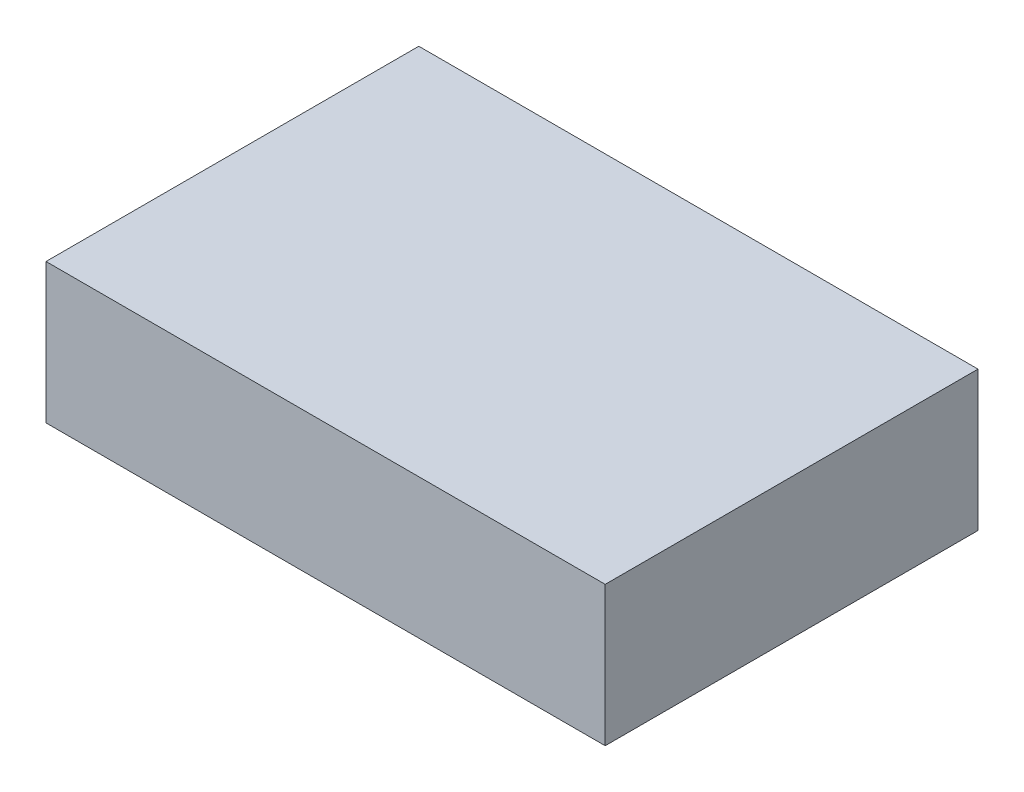
ISO-10303-21;
HEADER;
FILE_DESCRIPTION(('STEP AP214'),'2;1');
FILE_NAME('part.step','',(''),(''),'','','');
FILE_SCHEMA(('AUTOMOTIVE_DESIGN { 1 0 10303 214 1 1 1 1 }'));
ENDSEC;
DATA;
#1=APPLICATION_CONTEXT('core data for automotive mechanical design processes');
#2=APPLICATION_PROTOCOL_DEFINITION('international standard','automotive_design',2000,#1);
#3=PRODUCT_CONTEXT('',#1,'mechanical');
#4=PRODUCT('Part','Part','',(#3));
#5=PRODUCT_RELATED_PRODUCT_CATEGORY('part','',(#4));
#6=PRODUCT_DEFINITION_FORMATION('','',#4);
#7=PRODUCT_DEFINITION_CONTEXT('part definition',#1,'design');
#8=PRODUCT_DEFINITION('design','',#6,#7);
#9=PRODUCT_DEFINITION_SHAPE('','',#8);
#10=(LENGTH_UNIT() NAMED_UNIT(*) SI_UNIT(.MILLI.,.METRE.));
#11=(NAMED_UNIT(*) PLANE_ANGLE_UNIT() SI_UNIT($,.RADIAN.));
#12=(NAMED_UNIT(*) SI_UNIT($,.STERADIAN.) SOLID_ANGLE_UNIT());
#13=UNCERTAINTY_MEASURE_WITH_UNIT(LENGTH_MEASURE(1.E-05),#10,'distance_accuracy_value','');
#14=(GEOMETRIC_REPRESENTATION_CONTEXT(3) GLOBAL_UNCERTAINTY_ASSIGNED_CONTEXT((#13)) GLOBAL_UNIT_ASSIGNED_CONTEXT((#10,
#11,#12)) REPRESENTATION_CONTEXT('',''));
#15=CARTESIAN_POINT('',(0.,0.,0.));
#16=DIRECTION('',(0.,0.,1.));
#17=DIRECTION('',(1.,0.,0.));
#18=AXIS2_PLACEMENT_3D('',#15,#16,#17);
#19=CARTESIAN_POINT('',(-60.,30.,40.));
#20=DIRECTION('',(1.,0.,0.));
#21=DIRECTION('',(0.,0.,-1.));
#22=AXIS2_PLACEMENT_3D('',#19,#20,#21);
#23=PLANE('',#22);
#24=DIRECTION('',(0.,0.,1.));
#25=VECTOR('',#24,1.);
#26=CARTESIAN_POINT('',(-60.,0.,40.));
#27=LINE('',#26,#25);
#28=CARTESIAN_POINT('',(-60.,0.,-40.));
#29=VERTEX_POINT('',#28);
#30=CARTESIAN_POINT('',(-60.,0.,40.));
#31=VERTEX_POINT('',#30);
#32=EDGE_CURVE('E96',#29,#31,#27,.T.);
#33=ORIENTED_EDGE('',*,*,#32,.T.);
#34=DIRECTION('',(0.,-1.,0.));
#35=VECTOR('',#34,1.);
#36=CARTESIAN_POINT('',(-60.,30.,40.));
#37=LINE('',#36,#35);
#38=CARTESIAN_POINT('',(-60.,30.,40.));
#39=VERTEX_POINT('',#38);
#40=EDGE_CURVE('E11',#39,#31,#37,.T.);
#41=ORIENTED_EDGE('',*,*,#40,.F.);
#42=DIRECTION('',(0.,0.,1.));
#43=VECTOR('',#42,1.);
#44=CARTESIAN_POINT('',(-60.,30.,40.));
#45=LINE('',#44,#43);
#46=CARTESIAN_POINT('',(-60.,30.,-40.));
#47=VERTEX_POINT('',#46);
#48=EDGE_CURVE('E84',#47,#39,#45,.T.);
#49=ORIENTED_EDGE('',*,*,#48,.F.);
#50=DIRECTION('',(0.,-1.,0.));
#51=VECTOR('',#50,1.);
#52=CARTESIAN_POINT('',(-60.,30.,-40.));
#53=LINE('',#52,#51);
#54=EDGE_CURVE('E92',#47,#29,#53,.T.);
#55=ORIENTED_EDGE('',*,*,#54,.T.);
#56=EDGE_LOOP('',(#33,#41,#49,#55));
#57=FACE_BOUND('',#56,.T.);
#58=ADVANCED_FACE('F33',(#57),#23,.F.);
#59=CARTESIAN_POINT('',(60.,30.,40.));
#60=DIRECTION('',(0.,0.,-1.));
#61=DIRECTION('',(-1.,0.,0.));
#62=AXIS2_PLACEMENT_3D('',#59,#60,#61);
#63=PLANE('',#62);
#64=DIRECTION('',(1.,0.,0.));
#65=VECTOR('',#64,1.);
#66=CARTESIAN_POINT('',(60.,0.,40.));
#67=LINE('',#66,#65);
#68=CARTESIAN_POINT('',(60.,0.,40.));
#69=VERTEX_POINT('',#68);
#70=EDGE_CURVE('E88',#31,#69,#67,.T.);
#71=ORIENTED_EDGE('',*,*,#70,.T.);
#72=DIRECTION('',(0.,-1.,0.));
#73=VECTOR('',#72,1.);
#74=CARTESIAN_POINT('',(60.,30.,40.));
#75=LINE('',#74,#73);
#76=CARTESIAN_POINT('',(60.,30.,40.));
#77=VERTEX_POINT('',#76);
#78=EDGE_CURVE('E41',#77,#69,#75,.T.);
#79=ORIENTED_EDGE('',*,*,#78,.F.);
#80=DIRECTION('',(1.,0.,0.));
#81=VECTOR('',#80,1.);
#82=CARTESIAN_POINT('',(60.,30.,40.));
#83=LINE('',#82,#81);
#84=EDGE_CURVE('E79',#39,#77,#83,.T.);
#85=ORIENTED_EDGE('',*,*,#84,.F.);
#86=ORIENTED_EDGE('',*,*,#40,.T.);
#87=EDGE_LOOP('',(#71,#79,#85,#86));
#88=FACE_BOUND('',#87,.T.);
#89=ADVANCED_FACE('F87',(#88),#63,.F.);
#90=CARTESIAN_POINT('',(60.,30.,40.));
#91=DIRECTION('',(-1.,0.,0.));
#92=DIRECTION('',(0.,0.,1.));
#93=AXIS2_PLACEMENT_3D('',#90,#91,#92);
#94=PLANE('',#93);
#95=DIRECTION('',(0.,0.,-1.));
#96=VECTOR('',#95,1.);
#97=CARTESIAN_POINT('',(60.,0.,40.));
#98=LINE('',#97,#96);
#99=CARTESIAN_POINT('',(60.,0.,-40.));
#100=VERTEX_POINT('',#99);
#101=EDGE_CURVE('E66',#69,#100,#98,.T.);
#102=ORIENTED_EDGE('',*,*,#101,.T.);
#103=DIRECTION('',(0.,-1.,0.));
#104=VECTOR('',#103,1.);
#105=CARTESIAN_POINT('',(60.,30.,-40.));
#106=LINE('',#105,#104);
#107=CARTESIAN_POINT('',(60.,30.,-40.));
#108=VERTEX_POINT('',#107);
#109=EDGE_CURVE('E89',#108,#100,#106,.T.);
#110=ORIENTED_EDGE('',*,*,#109,.F.);
#111=DIRECTION('',(0.,0.,-1.));
#112=VECTOR('',#111,1.);
#113=CARTESIAN_POINT('',(60.,30.,40.));
#114=LINE('',#113,#112);
#115=EDGE_CURVE('E82',#77,#108,#114,.T.);
#116=ORIENTED_EDGE('',*,*,#115,.F.);
#117=ORIENTED_EDGE('',*,*,#78,.T.);
#118=EDGE_LOOP('',(#102,#110,#116,#117));
#119=FACE_BOUND('',#118,.T.);
#120=ADVANCED_FACE('F90',(#119),#94,.F.);
#121=CARTESIAN_POINT('',(60.,30.,-40.));
#122=DIRECTION('',(0.,0.,1.));
#123=DIRECTION('',(1.,0.,0.));
#124=AXIS2_PLACEMENT_3D('',#121,#122,#123);
#125=PLANE('',#124);
#126=DIRECTION('',(-1.,0.,0.));
#127=VECTOR('',#126,1.);
#128=CARTESIAN_POINT('',(60.,0.,-40.));
#129=LINE('',#128,#127);
#130=EDGE_CURVE('E72',#100,#29,#129,.T.);
#131=ORIENTED_EDGE('',*,*,#130,.T.);
#132=ORIENTED_EDGE('',*,*,#54,.F.);
#133=DIRECTION('',(-1.,0.,0.));
#134=VECTOR('',#133,1.);
#135=CARTESIAN_POINT('',(60.,30.,-40.));
#136=LINE('',#135,#134);
#137=EDGE_CURVE('E49',#108,#47,#136,.T.);
#138=ORIENTED_EDGE('',*,*,#137,.F.);
#139=ORIENTED_EDGE('',*,*,#109,.T.);
#140=EDGE_LOOP('',(#131,#132,#138,#139));
#141=FACE_BOUND('',#140,.T.);
#142=ADVANCED_FACE('F103',(#141),#125,.F.);
#143=CARTESIAN_POINT('',(0.,30.,0.));
#144=DIRECTION('',(0.,1.,0.));
#145=DIRECTION('',(0.,0.,1.));
#146=AXIS2_PLACEMENT_3D('',#143,#144,#145);
#147=PLANE('',#146);
#148=ORIENTED_EDGE('',*,*,#48,.T.);
#149=ORIENTED_EDGE('',*,*,#84,.T.);
#150=ORIENTED_EDGE('',*,*,#115,.T.);
#151=ORIENTED_EDGE('',*,*,#137,.T.);
#152=EDGE_LOOP('',(#148,#149,#150,#151));
#153=FACE_BOUND('',#152,.T.);
#154=ADVANCED_FACE('F80',(#153),#147,.T.);
#155=CARTESIAN_POINT('',(0.,0.,0.));
#156=DIRECTION('',(0.,1.,0.));
#157=DIRECTION('',(0.,0.,1.));
#158=AXIS2_PLACEMENT_3D('',#155,#156,#157);
#159=PLANE('',#158);
#160=ORIENTED_EDGE('',*,*,#32,.F.);
#161=ORIENTED_EDGE('',*,*,#130,.F.);
#162=ORIENTED_EDGE('',*,*,#101,.F.);
#163=ORIENTED_EDGE('',*,*,#70,.F.);
#164=EDGE_LOOP('',(#160,#161,#162,#163));
#165=FACE_BOUND('',#164,.T.);
#166=ADVANCED_FACE('F106',(#165),#159,.F.);
#167=CLOSED_SHELL('',(#58,#89,#120,#142,#154,#166));
#168=MANIFOLD_SOLID_BREP('B2',#167);
#169=ADVANCED_BREP_SHAPE_REPRESENTATION('',(#18,#168),#14);
#170=SHAPE_DEFINITION_REPRESENTATION(#9,#169);
ENDSEC;
END-ISO-10303-21;
